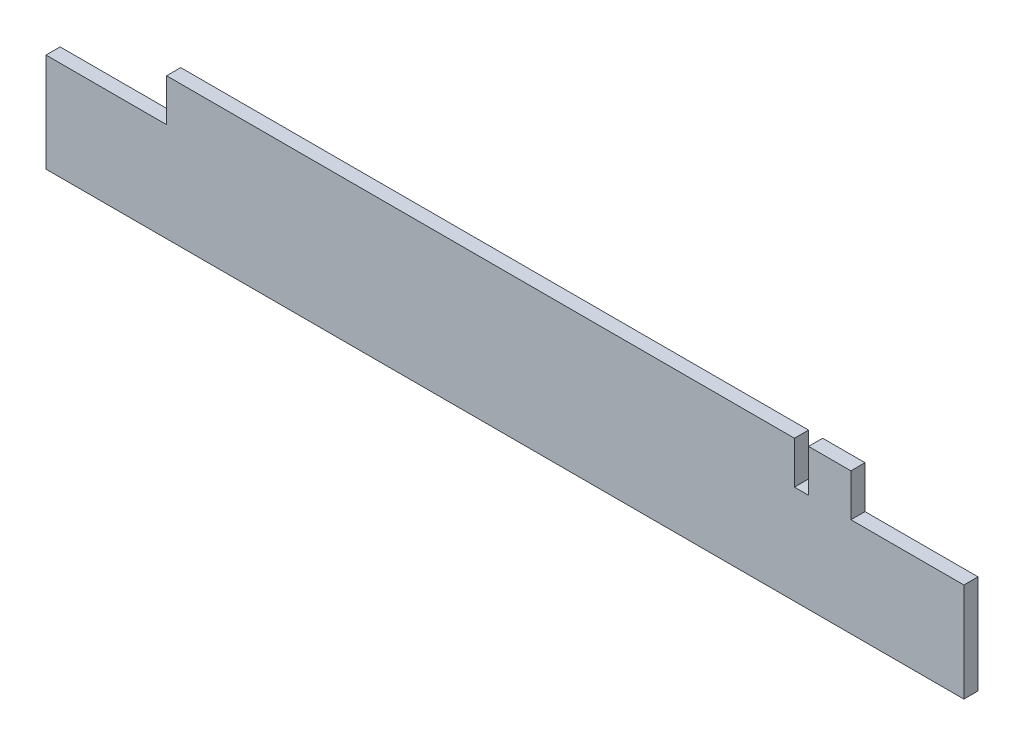
ISO-10303-21;
HEADER;
FILE_DESCRIPTION(('STEP AP214'),'2;1');
FILE_NAME('part.step','',(''),(''),'','','');
FILE_SCHEMA(('AUTOMOTIVE_DESIGN { 1 0 10303 214 1 1 1 1 }'));
ENDSEC;
DATA;
#1=APPLICATION_CONTEXT('core data for automotive mechanical design processes');
#2=APPLICATION_PROTOCOL_DEFINITION('international standard','automotive_design',2000,#1);
#3=PRODUCT_CONTEXT('',#1,'mechanical');
#4=PRODUCT('Part','Part','',(#3));
#5=PRODUCT_RELATED_PRODUCT_CATEGORY('part','',(#4));
#6=PRODUCT_DEFINITION_FORMATION('','',#4);
#7=PRODUCT_DEFINITION_CONTEXT('part definition',#1,'design');
#8=PRODUCT_DEFINITION('design','',#6,#7);
#9=PRODUCT_DEFINITION_SHAPE('','',#8);
#10=(LENGTH_UNIT() NAMED_UNIT(*) SI_UNIT(.MILLI.,.METRE.));
#11=(NAMED_UNIT(*) PLANE_ANGLE_UNIT() SI_UNIT($,.RADIAN.));
#12=(NAMED_UNIT(*) SI_UNIT($,.STERADIAN.) SOLID_ANGLE_UNIT());
#13=UNCERTAINTY_MEASURE_WITH_UNIT(LENGTH_MEASURE(1.E-05),#10,'distance_accuracy_value','');
#14=(GEOMETRIC_REPRESENTATION_CONTEXT(3) GLOBAL_UNCERTAINTY_ASSIGNED_CONTEXT((#13)) GLOBAL_UNIT_ASSIGNED_CONTEXT((#10,
#11,#12)) REPRESENTATION_CONTEXT('',''));
#15=CARTESIAN_POINT('',(0.,0.,0.));
#16=DIRECTION('',(0.,0.,1.));
#17=DIRECTION('',(1.,0.,0.));
#18=AXIS2_PLACEMENT_3D('',#15,#16,#17);
#19=CARTESIAN_POINT('',(0.,-119.452554744526,10.));
#20=DIRECTION('',(0.,1.,0.));
#21=DIRECTION('',(-1.,0.,0.));
#22=AXIS2_PLACEMENT_3D('',#19,#20,#21);
#23=PLANE('',#22);
#24=DIRECTION('',(0.,0.,-1.));
#25=VECTOR('',#24,1.);
#26=CARTESIAN_POINT('',(215.,-119.452554744526,10.));
#27=LINE('',#26,#25);
#28=CARTESIAN_POINT('',(215.,-119.452554744526,10.));
#29=VERTEX_POINT('',#28);
#30=CARTESIAN_POINT('',(215.,-119.452554744526,0.));
#31=VERTEX_POINT('',#30);
#32=EDGE_CURVE('E164',#29,#31,#27,.T.);
#33=ORIENTED_EDGE('',*,*,#32,.F.);
#34=DIRECTION('',(1.,0.,0.));
#35=VECTOR('',#34,1.);
#36=CARTESIAN_POINT('',(0.,-119.452554744526,10.));
#37=LINE('',#36,#35);
#38=CARTESIAN_POINT('',(245.,-119.452554744526,10.));
#39=VERTEX_POINT('',#38);
#40=EDGE_CURVE('E113',#29,#39,#37,.T.);
#41=ORIENTED_EDGE('',*,*,#40,.T.);
#42=DIRECTION('',(0.,0.,-1.));
#43=VECTOR('',#42,1.);
#44=CARTESIAN_POINT('',(245.,-119.452554744526,10.));
#45=LINE('',#44,#43);
#46=CARTESIAN_POINT('',(245.,-119.452554744526,0.));
#47=VERTEX_POINT('',#46);
#48=EDGE_CURVE('E11',#39,#47,#45,.T.);
#49=ORIENTED_EDGE('',*,*,#48,.T.);
#50=DIRECTION('',(1.,0.,0.));
#51=VECTOR('',#50,1.);
#52=CARTESIAN_POINT('',(0.,-119.452554744526,0.));
#53=LINE('',#52,#51);
#54=EDGE_CURVE('E163',#31,#47,#53,.T.);
#55=ORIENTED_EDGE('',*,*,#54,.F.);
#56=EDGE_LOOP('',(#33,#41,#49,#55));
#57=FACE_BOUND('',#56,.T.);
#58=ADVANCED_FACE('F48',(#57),#23,.T.);
#59=CARTESIAN_POINT('',(245.,0.,10.));
#60=DIRECTION('',(1.,0.,0.));
#61=DIRECTION('',(0.,0.,-1.));
#62=AXIS2_PLACEMENT_3D('',#59,#60,#61);
#63=PLANE('',#62);
#64=DIRECTION('',(0.,-1.,0.));
#65=VECTOR('',#64,1.);
#66=CARTESIAN_POINT('',(245.,0.,0.));
#67=LINE('',#66,#65);
#68=CARTESIAN_POINT('',(245.,-149.452554744526,0.));
#69=VERTEX_POINT('',#68);
#70=EDGE_CURVE('E160',#47,#69,#67,.T.);
#71=ORIENTED_EDGE('',*,*,#70,.F.);
#72=ORIENTED_EDGE('',*,*,#48,.F.);
#73=DIRECTION('',(0.,-1.,0.));
#74=VECTOR('',#73,1.);
#75=CARTESIAN_POINT('',(245.,0.,10.));
#76=LINE('',#75,#74);
#77=CARTESIAN_POINT('',(245.,-149.452554744526,10.));
#78=VERTEX_POINT('',#77);
#79=EDGE_CURVE('E182',#39,#78,#76,.T.);
#80=ORIENTED_EDGE('',*,*,#79,.T.);
#81=DIRECTION('',(0.,0.,-1.));
#82=VECTOR('',#81,1.);
#83=CARTESIAN_POINT('',(245.,-149.452554744526,10.));
#84=LINE('',#83,#82);
#85=EDGE_CURVE('E105',#78,#69,#84,.T.);
#86=ORIENTED_EDGE('',*,*,#85,.T.);
#87=EDGE_LOOP('',(#71,#72,#80,#86));
#88=FACE_BOUND('',#87,.T.);
#89=ADVANCED_FACE('F50',(#88),#63,.T.);
#90=DIRECTION('',(0.,0.,-1.));
#91=VECTOR('',#90,1.);
#92=CARTESIAN_POINT('',(205.,-119.452554744526,10.));
#93=LINE('',#92,#91);
#94=CARTESIAN_POINT('',(205.,-119.452554744526,10.));
#95=VERTEX_POINT('',#94);
#96=CARTESIAN_POINT('',(205.,-119.452554744526,0.));
#97=VERTEX_POINT('',#96);
#98=EDGE_CURVE('E208',#95,#97,#93,.T.);
#99=ORIENTED_EDGE('',*,*,#98,.T.);
#100=CARTESIAN_POINT('',(-239.598540145985,-119.452554744526,0.));
#101=VERTEX_POINT('',#100);
#102=EDGE_CURVE('E165',#101,#97,#53,.T.);
#103=ORIENTED_EDGE('',*,*,#102,.F.);
#104=DIRECTION('',(0.,0.,-1.));
#105=VECTOR('',#104,1.);
#106=CARTESIAN_POINT('',(-239.598540145985,-119.452554744526,10.));
#107=LINE('',#106,#105);
#108=CARTESIAN_POINT('',(-239.598540145985,-119.452554744526,10.));
#109=VERTEX_POINT('',#108);
#110=EDGE_CURVE('E56',#109,#101,#107,.T.);
#111=ORIENTED_EDGE('',*,*,#110,.F.);
#112=EDGE_CURVE('E210',#109,#95,#37,.T.);
#113=ORIENTED_EDGE('',*,*,#112,.T.);
#114=EDGE_LOOP('',(#99,#103,#111,#113));
#115=FACE_BOUND('',#114,.T.);
#116=ADVANCED_FACE('F206',(#115),#23,.T.);
#117=CARTESIAN_POINT('',(-239.598540145985,2.21673179947207E-13,10.));
#118=DIRECTION('',(1.,0.,0.));
#119=DIRECTION('',(0.,1.,0.));
#120=AXIS2_PLACEMENT_3D('',#117,#118,#119);
#121=PLANE('',#120);
#122=DIRECTION('',(0.,-1.,0.));
#123=VECTOR('',#122,1.);
#124=CARTESIAN_POINT('',(-239.598540145985,2.21673179947207E-13,0.));
#125=LINE('',#124,#123);
#126=CARTESIAN_POINT('',(-239.598540145986,-149.452554744526,0.));
#127=VERTEX_POINT('',#126);
#128=EDGE_CURVE('E168',#101,#127,#125,.T.);
#129=ORIENTED_EDGE('',*,*,#128,.T.);
#130=DIRECTION('',(0.,0.,-1.));
#131=VECTOR('',#130,1.);
#132=CARTESIAN_POINT('',(-239.598540145986,-149.452554744526,10.));
#133=LINE('',#132,#131);
#134=CARTESIAN_POINT('',(-239.598540145986,-149.452554744526,10.));
#135=VERTEX_POINT('',#134);
#136=EDGE_CURVE('E188',#135,#127,#133,.T.);
#137=ORIENTED_EDGE('',*,*,#136,.F.);
#138=DIRECTION('',(0.,-1.,0.));
#139=VECTOR('',#138,1.);
#140=CARTESIAN_POINT('',(-239.598540145985,2.21673179947207E-13,10.));
#141=LINE('',#140,#139);
#142=EDGE_CURVE('E194',#109,#135,#141,.T.);
#143=ORIENTED_EDGE('',*,*,#142,.F.);
#144=ORIENTED_EDGE('',*,*,#110,.T.);
#145=EDGE_LOOP('',(#129,#137,#143,#144));
#146=FACE_BOUND('',#145,.T.);
#147=ADVANCED_FACE('F192',(#146),#121,.F.);
#148=CARTESIAN_POINT('',(0.,-149.452554744526,10.));
#149=DIRECTION('',(0.,1.,0.));
#150=DIRECTION('',(0.,0.,1.));
#151=AXIS2_PLACEMENT_3D('',#148,#149,#150);
#152=PLANE('',#151);
#153=DIRECTION('',(1.,0.,0.));
#154=VECTOR('',#153,1.);
#155=CARTESIAN_POINT('',(0.,-149.452554744526,0.));
#156=LINE('',#155,#154);
#157=CARTESIAN_POINT('',(-325.,-149.452554744526,0.));
#158=VERTEX_POINT('',#157);
#159=EDGE_CURVE('E171',#158,#127,#156,.T.);
#160=ORIENTED_EDGE('',*,*,#159,.F.);
#161=DIRECTION('',(0.,0.,-1.));
#162=VECTOR('',#161,1.);
#163=CARTESIAN_POINT('',(-325.,-149.452554744526,10.));
#164=LINE('',#163,#162);
#165=CARTESIAN_POINT('',(-325.,-149.452554744526,10.));
#166=VERTEX_POINT('',#165);
#167=EDGE_CURVE('E186',#166,#158,#164,.T.);
#168=ORIENTED_EDGE('',*,*,#167,.F.);
#169=DIRECTION('',(1.,0.,0.));
#170=VECTOR('',#169,1.);
#171=CARTESIAN_POINT('',(0.,-149.452554744526,10.));
#172=LINE('',#171,#170);
#173=EDGE_CURVE('E229',#166,#135,#172,.T.);
#174=ORIENTED_EDGE('',*,*,#173,.T.);
#175=ORIENTED_EDGE('',*,*,#136,.T.);
#176=EDGE_LOOP('',(#160,#168,#174,#175));
#177=FACE_BOUND('',#176,.T.);
#178=ADVANCED_FACE('F274',(#177),#152,.T.);
#179=CARTESIAN_POINT('',(-325.,0.,10.));
#180=DIRECTION('',(-1.,0.,0.));
#181=DIRECTION('',(0.,0.,1.));
#182=AXIS2_PLACEMENT_3D('',#179,#180,#181);
#183=PLANE('',#182);
#184=DIRECTION('',(0.,1.,0.));
#185=VECTOR('',#184,1.);
#186=CARTESIAN_POINT('',(-325.,0.,0.));
#187=LINE('',#186,#185);
#188=CARTESIAN_POINT('',(-325.,-219.452554744526,0.));
#189=VERTEX_POINT('',#188);
#190=EDGE_CURVE('E174',#189,#158,#187,.T.);
#191=ORIENTED_EDGE('',*,*,#190,.F.);
#192=DIRECTION('',(0.,0.,-1.));
#193=VECTOR('',#192,1.);
#194=CARTESIAN_POINT('',(-325.,-219.452554744526,10.));
#195=LINE('',#194,#193);
#196=CARTESIAN_POINT('',(-325.,-219.452554744526,10.));
#197=VERTEX_POINT('',#196);
#198=EDGE_CURVE('E151',#197,#189,#195,.T.);
#199=ORIENTED_EDGE('',*,*,#198,.F.);
#200=DIRECTION('',(0.,1.,0.));
#201=VECTOR('',#200,1.);
#202=CARTESIAN_POINT('',(-325.,0.,10.));
#203=LINE('',#202,#201);
#204=EDGE_CURVE('E141',#197,#166,#203,.T.);
#205=ORIENTED_EDGE('',*,*,#204,.T.);
#206=ORIENTED_EDGE('',*,*,#167,.T.);
#207=EDGE_LOOP('',(#191,#199,#205,#206));
#208=FACE_BOUND('',#207,.T.);
#209=ADVANCED_FACE('F233',(#208),#183,.T.);
#210=CARTESIAN_POINT('',(0.,-219.452554744526,10.));
#211=DIRECTION('',(0.,1.,0.));
#212=DIRECTION('',(-1.,0.,0.));
#213=AXIS2_PLACEMENT_3D('',#210,#211,#212);
#214=PLANE('',#213);
#215=DIRECTION('',(1.,0.,0.));
#216=VECTOR('',#215,1.);
#217=CARTESIAN_POINT('',(0.,-219.452554744526,0.));
#218=LINE('',#217,#216);
#219=CARTESIAN_POINT('',(325.,-219.452554744526,0.));
#220=VERTEX_POINT('',#219);
#221=EDGE_CURVE('E148',#189,#220,#218,.T.);
#222=ORIENTED_EDGE('',*,*,#221,.T.);
#223=DIRECTION('',(0.,0.,-1.));
#224=VECTOR('',#223,1.);
#225=CARTESIAN_POINT('',(325.,-219.452554744526,10.));
#226=LINE('',#225,#224);
#227=CARTESIAN_POINT('',(325.,-219.452554744526,10.));
#228=VERTEX_POINT('',#227);
#229=EDGE_CURVE('E145',#228,#220,#226,.T.);
#230=ORIENTED_EDGE('',*,*,#229,.F.);
#231=DIRECTION('',(1.,0.,0.));
#232=VECTOR('',#231,1.);
#233=CARTESIAN_POINT('',(0.,-219.452554744526,10.));
#234=LINE('',#233,#232);
#235=EDGE_CURVE('E132',#197,#228,#234,.T.);
#236=ORIENTED_EDGE('',*,*,#235,.F.);
#237=ORIENTED_EDGE('',*,*,#198,.T.);
#238=EDGE_LOOP('',(#222,#230,#236,#237));
#239=FACE_BOUND('',#238,.T.);
#240=ADVANCED_FACE('F146',(#239),#214,.F.);
#241=CARTESIAN_POINT('',(325.,0.,10.));
#242=DIRECTION('',(-1.,0.,0.));
#243=DIRECTION('',(0.,0.,1.));
#244=AXIS2_PLACEMENT_3D('',#241,#242,#243);
#245=PLANE('',#244);
#246=DIRECTION('',(0.,1.,0.));
#247=VECTOR('',#246,1.);
#248=CARTESIAN_POINT('',(325.,0.,0.));
#249=LINE('',#248,#247);
#250=CARTESIAN_POINT('',(325.,-149.452554744526,0.));
#251=VERTEX_POINT('',#250);
#252=EDGE_CURVE('E178',#220,#251,#249,.T.);
#253=ORIENTED_EDGE('',*,*,#252,.T.);
#254=DIRECTION('',(0.,0.,-1.));
#255=VECTOR('',#254,1.);
#256=CARTESIAN_POINT('',(325.,-149.452554744526,10.));
#257=LINE('',#256,#255);
#258=CARTESIAN_POINT('',(325.,-149.452554744526,10.));
#259=VERTEX_POINT('',#258);
#260=EDGE_CURVE('E152',#259,#251,#257,.T.);
#261=ORIENTED_EDGE('',*,*,#260,.F.);
#262=DIRECTION('',(0.,1.,0.));
#263=VECTOR('',#262,1.);
#264=CARTESIAN_POINT('',(325.,0.,10.));
#265=LINE('',#264,#263);
#266=EDGE_CURVE('E137',#228,#259,#265,.T.);
#267=ORIENTED_EDGE('',*,*,#266,.F.);
#268=ORIENTED_EDGE('',*,*,#229,.T.);
#269=EDGE_LOOP('',(#253,#261,#267,#268));
#270=FACE_BOUND('',#269,.T.);
#271=ADVANCED_FACE('F154',(#270),#245,.F.);
#272=CARTESIAN_POINT('',(0.,-149.452554744526,10.));
#273=DIRECTION('',(0.,-1.,0.));
#274=DIRECTION('',(0.,0.,-1.));
#275=AXIS2_PLACEMENT_3D('',#272,#273,#274);
#276=PLANE('',#275);
#277=DIRECTION('',(-1.,0.,0.));
#278=VECTOR('',#277,1.);
#279=CARTESIAN_POINT('',(0.,-149.452554744526,0.));
#280=LINE('',#279,#278);
#281=EDGE_CURVE('E180',#251,#69,#280,.T.);
#282=ORIENTED_EDGE('',*,*,#281,.T.);
#283=ORIENTED_EDGE('',*,*,#85,.F.);
#284=DIRECTION('',(-1.,0.,0.));
#285=VECTOR('',#284,1.);
#286=CARTESIAN_POINT('',(0.,-149.452554744526,10.));
#287=LINE('',#286,#285);
#288=EDGE_CURVE('E72',#259,#78,#287,.T.);
#289=ORIENTED_EDGE('',*,*,#288,.F.);
#290=ORIENTED_EDGE('',*,*,#260,.T.);
#291=EDGE_LOOP('',(#282,#283,#289,#290));
#292=FACE_BOUND('',#291,.T.);
#293=ADVANCED_FACE('F236',(#292),#276,.F.);
#294=CARTESIAN_POINT('',(0.,0.,10.));
#295=DIRECTION('',(0.,0.,1.));
#296=DIRECTION('',(1.,0.,0.));
#297=AXIS2_PLACEMENT_3D('',#294,#295,#296);
#298=PLANE('',#297);
#299=DIRECTION('',(0.,-1.,0.));
#300=VECTOR('',#299,1.);
#301=CARTESIAN_POINT('',(215.,-119.452554744526,10.));
#302=LINE('',#301,#300);
#303=CARTESIAN_POINT('',(215.,-149.452554744526,10.));
#304=VERTEX_POINT('',#303);
#305=EDGE_CURVE('E240',#29,#304,#302,.T.);
#306=ORIENTED_EDGE('',*,*,#305,.T.);
#307=DIRECTION('',(-1.,0.,0.));
#308=VECTOR('',#307,1.);
#309=CARTESIAN_POINT('',(215.,-149.452554744526,10.));
#310=LINE('',#309,#308);
#311=CARTESIAN_POINT('',(205.,-149.452554744526,10.));
#312=VERTEX_POINT('',#311);
#313=EDGE_CURVE('E255',#304,#312,#310,.T.);
#314=ORIENTED_EDGE('',*,*,#313,.T.);
#315=DIRECTION('',(0.,1.,0.));
#316=VECTOR('',#315,1.);
#317=CARTESIAN_POINT('',(205.,-119.452554744526,10.));
#318=LINE('',#317,#316);
#319=EDGE_CURVE('E225',#312,#95,#318,.T.);
#320=ORIENTED_EDGE('',*,*,#319,.T.);
#321=ORIENTED_EDGE('',*,*,#112,.F.);
#322=ORIENTED_EDGE('',*,*,#142,.T.);
#323=ORIENTED_EDGE('',*,*,#173,.F.);
#324=ORIENTED_EDGE('',*,*,#204,.F.);
#325=ORIENTED_EDGE('',*,*,#235,.T.);
#326=ORIENTED_EDGE('',*,*,#266,.T.);
#327=ORIENTED_EDGE('',*,*,#288,.T.);
#328=ORIENTED_EDGE('',*,*,#79,.F.);
#329=ORIENTED_EDGE('',*,*,#40,.F.);
#330=EDGE_LOOP('',(#306,#314,#320,#321,#322,#323,#324,#325,#326,#327,#328,#329));
#331=FACE_BOUND('',#330,.T.);
#332=ADVANCED_FACE('F135',(#331),#298,.T.);
#333=CARTESIAN_POINT('',(0.,0.,0.));
#334=DIRECTION('',(0.,0.,1.));
#335=DIRECTION('',(1.,0.,0.));
#336=AXIS2_PLACEMENT_3D('',#333,#334,#335);
#337=PLANE('',#336);
#338=DIRECTION('',(-1.,0.,0.));
#339=VECTOR('',#338,1.);
#340=CARTESIAN_POINT('',(215.,-149.452554744526,0.));
#341=LINE('',#340,#339);
#342=CARTESIAN_POINT('',(215.,-149.452554744526,0.));
#343=VERTEX_POINT('',#342);
#344=CARTESIAN_POINT('',(205.,-149.452554744526,0.));
#345=VERTEX_POINT('',#344);
#346=EDGE_CURVE('E252',#343,#345,#341,.T.);
#347=ORIENTED_EDGE('',*,*,#346,.F.);
#348=DIRECTION('',(0.,-1.,0.));
#349=VECTOR('',#348,1.);
#350=CARTESIAN_POINT('',(215.,-119.452554744526,0.));
#351=LINE('',#350,#349);
#352=EDGE_CURVE('E63',#31,#343,#351,.T.);
#353=ORIENTED_EDGE('',*,*,#352,.F.);
#354=ORIENTED_EDGE('',*,*,#54,.T.);
#355=ORIENTED_EDGE('',*,*,#70,.T.);
#356=ORIENTED_EDGE('',*,*,#281,.F.);
#357=ORIENTED_EDGE('',*,*,#252,.F.);
#358=ORIENTED_EDGE('',*,*,#221,.F.);
#359=ORIENTED_EDGE('',*,*,#190,.T.);
#360=ORIENTED_EDGE('',*,*,#159,.T.);
#361=ORIENTED_EDGE('',*,*,#128,.F.);
#362=ORIENTED_EDGE('',*,*,#102,.T.);
#363=DIRECTION('',(0.,1.,0.));
#364=VECTOR('',#363,1.);
#365=CARTESIAN_POINT('',(205.,-119.452554744526,0.));
#366=LINE('',#365,#364);
#367=EDGE_CURVE('E249',#345,#97,#366,.T.);
#368=ORIENTED_EDGE('',*,*,#367,.F.);
#369=EDGE_LOOP('',(#347,#353,#354,#355,#356,#357,#358,#359,#360,#361,#362,#368));
#370=FACE_BOUND('',#369,.T.);
#371=ADVANCED_FACE('F201',(#370),#337,.F.);
#372=CARTESIAN_POINT('',(215.,-119.452554744526,10.));
#373=DIRECTION('',(1.,0.,0.));
#374=DIRECTION('',(0.,1.,0.));
#375=AXIS2_PLACEMENT_3D('',#372,#373,#374);
#376=PLANE('',#375);
#377=ORIENTED_EDGE('',*,*,#352,.T.);
#378=DIRECTION('',(0.,0.,-1.));
#379=VECTOR('',#378,1.);
#380=CARTESIAN_POINT('',(215.,-149.452554744526,10.));
#381=LINE('',#380,#379);
#382=EDGE_CURVE('E220',#304,#343,#381,.T.);
#383=ORIENTED_EDGE('',*,*,#382,.F.);
#384=ORIENTED_EDGE('',*,*,#305,.F.);
#385=ORIENTED_EDGE('',*,*,#32,.T.);
#386=EDGE_LOOP('',(#377,#383,#384,#385));
#387=FACE_BOUND('',#386,.T.);
#388=ADVANCED_FACE('F261',(#387),#376,.F.);
#389=CARTESIAN_POINT('',(205.,-119.452554744526,10.));
#390=DIRECTION('',(-1.,0.,0.));
#391=DIRECTION('',(0.,0.,1.));
#392=AXIS2_PLACEMENT_3D('',#389,#390,#391);
#393=PLANE('',#392);
#394=ORIENTED_EDGE('',*,*,#367,.T.);
#395=ORIENTED_EDGE('',*,*,#98,.F.);
#396=ORIENTED_EDGE('',*,*,#319,.F.);
#397=DIRECTION('',(0.,0.,-1.));
#398=VECTOR('',#397,1.);
#399=CARTESIAN_POINT('',(205.,-149.452554744526,10.));
#400=LINE('',#399,#398);
#401=EDGE_CURVE('E216',#312,#345,#400,.T.);
#402=ORIENTED_EDGE('',*,*,#401,.T.);
#403=EDGE_LOOP('',(#394,#395,#396,#402));
#404=FACE_BOUND('',#403,.T.);
#405=ADVANCED_FACE('F248',(#404),#393,.F.);
#406=CARTESIAN_POINT('',(215.,-149.452554744526,10.));
#407=DIRECTION('',(0.,-1.,0.));
#408=DIRECTION('',(0.,0.,-1.));
#409=AXIS2_PLACEMENT_3D('',#406,#407,#408);
#410=PLANE('',#409);
#411=ORIENTED_EDGE('',*,*,#346,.T.);
#412=ORIENTED_EDGE('',*,*,#401,.F.);
#413=ORIENTED_EDGE('',*,*,#313,.F.);
#414=ORIENTED_EDGE('',*,*,#382,.T.);
#415=EDGE_LOOP('',(#411,#412,#413,#414));
#416=FACE_BOUND('',#415,.T.);
#417=ADVANCED_FACE('F253',(#416),#410,.F.);
#418=CLOSED_SHELL('',(#58,#89,#116,#147,#178,#209,#240,#271,#293,#332,#371,#388,#405,#417));
#419=MANIFOLD_SOLID_BREP('B2',#418);
#420=ADVANCED_BREP_SHAPE_REPRESENTATION('',(#18,#419),#14);
#421=SHAPE_DEFINITION_REPRESENTATION(#9,#420);
ENDSEC;
END-ISO-10303-21;
